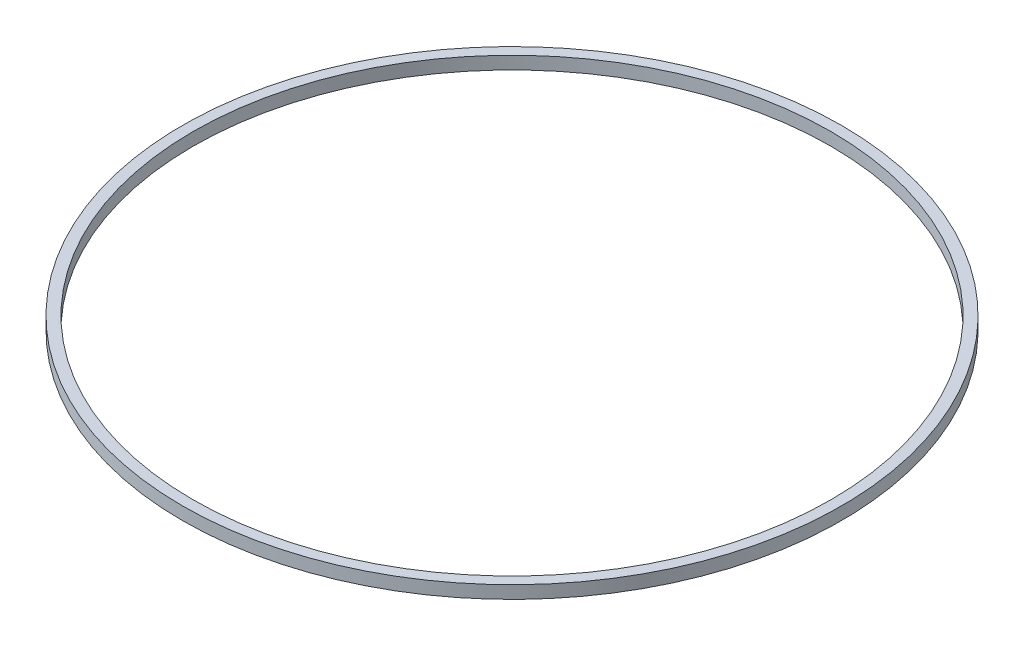
ISO-10303-21;
HEADER;
FILE_DESCRIPTION(('STEP AP214'),'2;1');
FILE_NAME('part.step','',(''),(''),'','','');
FILE_SCHEMA(('AUTOMOTIVE_DESIGN { 1 0 10303 214 1 1 1 1 }'));
ENDSEC;
DATA;
#1=APPLICATION_CONTEXT('core data for automotive mechanical design processes');
#2=APPLICATION_PROTOCOL_DEFINITION('international standard','automotive_design',2000,#1);
#3=PRODUCT_CONTEXT('',#1,'mechanical');
#4=PRODUCT('Part','Part','',(#3));
#5=PRODUCT_RELATED_PRODUCT_CATEGORY('part','',(#4));
#6=PRODUCT_DEFINITION_FORMATION('','',#4);
#7=PRODUCT_DEFINITION_CONTEXT('part definition',#1,'design');
#8=PRODUCT_DEFINITION('design','',#6,#7);
#9=PRODUCT_DEFINITION_SHAPE('','',#8);
#10=(LENGTH_UNIT() NAMED_UNIT(*) SI_UNIT(.MILLI.,.METRE.));
#11=(NAMED_UNIT(*) PLANE_ANGLE_UNIT() SI_UNIT($,.RADIAN.));
#12=(NAMED_UNIT(*) SI_UNIT($,.STERADIAN.) SOLID_ANGLE_UNIT());
#13=UNCERTAINTY_MEASURE_WITH_UNIT(LENGTH_MEASURE(1.E-05),#10,'distance_accuracy_value','');
#14=(GEOMETRIC_REPRESENTATION_CONTEXT(3) GLOBAL_UNCERTAINTY_ASSIGNED_CONTEXT((#13)) GLOBAL_UNIT_ASSIGNED_CONTEXT((#10,
#11,#12)) REPRESENTATION_CONTEXT('',''));
#15=CARTESIAN_POINT('',(0.,0.,0.));
#16=DIRECTION('',(0.,0.,1.));
#17=DIRECTION('',(1.,0.,0.));
#18=AXIS2_PLACEMENT_3D('',#15,#16,#17);
#19=CARTESIAN_POINT('',(0.,3.,0.));
#20=DIRECTION('',(0.,1.,0.));
#21=DIRECTION('',(0.,0.,1.));
#22=AXIS2_PLACEMENT_3D('',#19,#20,#21);
#23=PLANE('',#22);
#24=CARTESIAN_POINT('',(0.,3.,0.));
#25=DIRECTION('',(0.,1.,0.));
#26=DIRECTION('',(0.,0.,1.));
#27=AXIS2_PLACEMENT_3D('',#24,#25,#26);
#28=CIRCLE('',#27,77.5);
#29=CARTESIAN_POINT('',(0.,3.,77.5));
#30=VERTEX_POINT('',#29);
#31=EDGE_CURVE('E10',#30,#30,#28,.T.);
#32=ORIENTED_EDGE('',*,*,#31,.T.);
#33=EDGE_LOOP('',(#32));
#34=FACE_BOUND('',#33,.T.);
#35=CARTESIAN_POINT('',(0.,3.,0.));
#36=DIRECTION('',(0.,1.,0.));
#37=DIRECTION('',(0.,0.,1.));
#38=AXIS2_PLACEMENT_3D('',#35,#36,#37);
#39=CIRCLE('',#38,75.);
#40=CARTESIAN_POINT('',(0.,3.,75.));
#41=VERTEX_POINT('',#40);
#42=EDGE_CURVE('E42',#41,#41,#39,.T.);
#43=ORIENTED_EDGE('',*,*,#42,.F.);
#44=EDGE_LOOP('',(#43));
#45=FACE_BOUND('',#44,.T.);
#46=ADVANCED_FACE('F31',(#34,#45),#23,.T.);
#47=CARTESIAN_POINT('',(0.,0.,0.));
#48=DIRECTION('',(0.,1.,0.));
#49=DIRECTION('',(0.,0.,1.));
#50=AXIS2_PLACEMENT_3D('',#47,#48,#49);
#51=PLANE('',#50);
#52=CARTESIAN_POINT('',(0.,0.,0.));
#53=DIRECTION('',(0.,1.,0.));
#54=DIRECTION('',(0.,0.,1.));
#55=AXIS2_PLACEMENT_3D('',#52,#53,#54);
#56=CIRCLE('',#55,77.5);
#57=CARTESIAN_POINT('',(0.,0.,77.5));
#58=VERTEX_POINT('',#57);
#59=EDGE_CURVE('E35',#58,#58,#56,.T.);
#60=ORIENTED_EDGE('',*,*,#59,.F.);
#61=EDGE_LOOP('',(#60));
#62=FACE_BOUND('',#61,.T.);
#63=CARTESIAN_POINT('',(0.,0.,0.));
#64=DIRECTION('',(0.,1.,0.));
#65=DIRECTION('',(0.,0.,1.));
#66=AXIS2_PLACEMENT_3D('',#63,#64,#65);
#67=CIRCLE('',#66,75.);
#68=CARTESIAN_POINT('',(0.,0.,75.));
#69=VERTEX_POINT('',#68);
#70=EDGE_CURVE('E44',#69,#69,#67,.T.);
#71=ORIENTED_EDGE('',*,*,#70,.T.);
#72=EDGE_LOOP('',(#71));
#73=FACE_BOUND('',#72,.T.);
#74=ADVANCED_FACE('F54',(#62,#73),#51,.F.);
#75=CARTESIAN_POINT('',(0.,3.,0.));
#76=DIRECTION('',(0.,-1.,0.));
#77=DIRECTION('',(0.,0.,-1.));
#78=AXIS2_PLACEMENT_3D('',#75,#76,#77);
#79=CYLINDRICAL_SURFACE('',#78,77.5);
#80=ORIENTED_EDGE('',*,*,#31,.F.);
#81=EDGE_LOOP('',(#80));
#82=FACE_BOUND('',#81,.T.);
#83=ORIENTED_EDGE('',*,*,#59,.T.);
#84=EDGE_LOOP('',(#83));
#85=FACE_BOUND('',#84,.T.);
#86=ADVANCED_FACE('F33',(#82,#85),#79,.T.);
#87=CARTESIAN_POINT('',(0.,3.,0.));
#88=DIRECTION('',(0.,-1.,0.));
#89=DIRECTION('',(0.,0.,-1.));
#90=AXIS2_PLACEMENT_3D('',#87,#88,#89);
#91=CYLINDRICAL_SURFACE('',#90,75.);
#92=ORIENTED_EDGE('',*,*,#42,.T.);
#93=EDGE_LOOP('',(#92));
#94=FACE_BOUND('',#93,.T.);
#95=ORIENTED_EDGE('',*,*,#70,.F.);
#96=EDGE_LOOP('',(#95));
#97=FACE_BOUND('',#96,.T.);
#98=ADVANCED_FACE('F50',(#94,#97),#91,.F.);
#99=CLOSED_SHELL('',(#46,#74,#86,#98));
#100=MANIFOLD_SOLID_BREP('B2',#99);
#101=ADVANCED_BREP_SHAPE_REPRESENTATION('',(#18,#100),#14);
#102=SHAPE_DEFINITION_REPRESENTATION(#9,#101);
ENDSEC;
END-ISO-10303-21;
